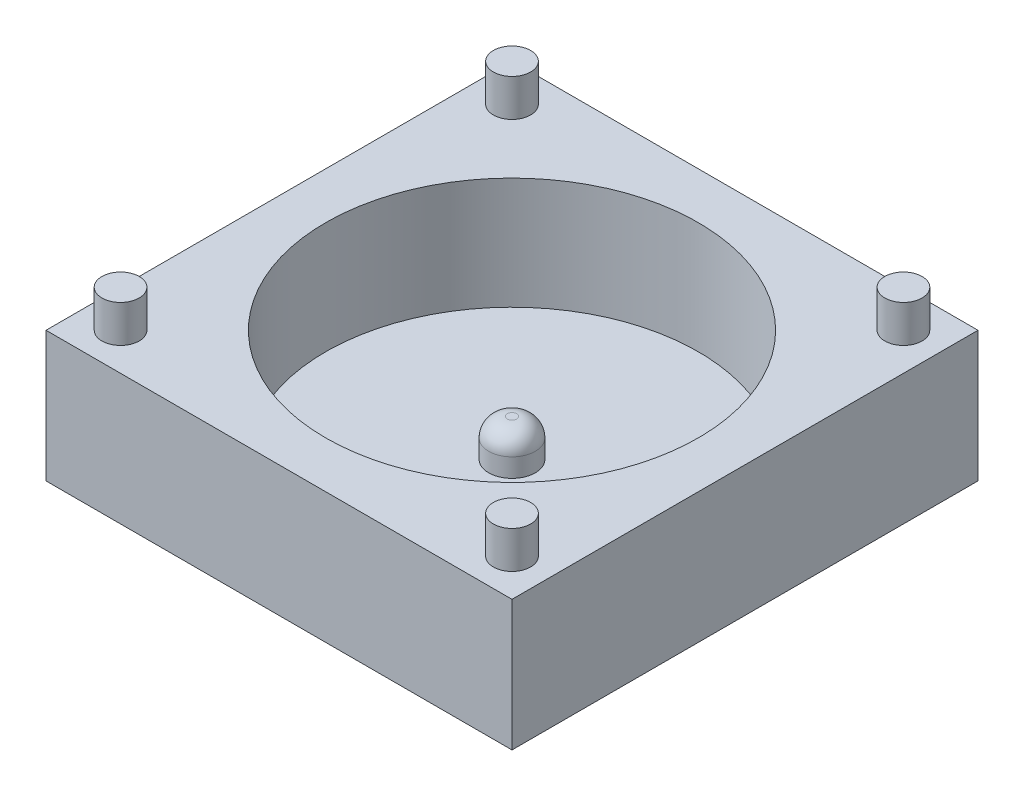
ISO-10303-21;
HEADER;
FILE_DESCRIPTION(('STEP AP214'),'2;1');
FILE_NAME('part.step','',(''),(''),'','','');
FILE_SCHEMA(('AUTOMOTIVE_DESIGN { 1 0 10303 214 1 1 1 1 }'));
ENDSEC;
DATA;
#1=APPLICATION_CONTEXT('core data for automotive mechanical design processes');
#2=APPLICATION_PROTOCOL_DEFINITION('international standard','automotive_design',2000,#1);
#3=PRODUCT_CONTEXT('',#1,'mechanical');
#4=PRODUCT('Part','Part','',(#3));
#5=PRODUCT_RELATED_PRODUCT_CATEGORY('part','',(#4));
#6=PRODUCT_DEFINITION_FORMATION('','',#4);
#7=PRODUCT_DEFINITION_CONTEXT('part definition',#1,'design');
#8=PRODUCT_DEFINITION('design','',#6,#7);
#9=PRODUCT_DEFINITION_SHAPE('','',#8);
#10=(LENGTH_UNIT() NAMED_UNIT(*) SI_UNIT(.MILLI.,.METRE.));
#11=(NAMED_UNIT(*) PLANE_ANGLE_UNIT() SI_UNIT($,.RADIAN.));
#12=(NAMED_UNIT(*) SI_UNIT($,.STERADIAN.) SOLID_ANGLE_UNIT());
#13=UNCERTAINTY_MEASURE_WITH_UNIT(LENGTH_MEASURE(1.E-05),#10,'distance_accuracy_value','');
#14=(GEOMETRIC_REPRESENTATION_CONTEXT(3) GLOBAL_UNCERTAINTY_ASSIGNED_CONTEXT((#13)) GLOBAL_UNIT_ASSIGNED_CONTEXT((#10,
#11,#12)) REPRESENTATION_CONTEXT('',''));
#15=CARTESIAN_POINT('',(0.,0.,0.));
#16=DIRECTION('',(0.,0.,1.));
#17=DIRECTION('',(1.,0.,0.));
#18=AXIS2_PLACEMENT_3D('',#15,#16,#17);
#19=CARTESIAN_POINT('',(12.5,7.,12.5));
#20=DIRECTION('',(-1.,0.,0.));
#21=DIRECTION('',(0.,0.,1.));
#22=AXIS2_PLACEMENT_3D('',#19,#20,#21);
#23=PLANE('',#22);
#24=DIRECTION('',(0.,0.,-1.));
#25=VECTOR('',#24,1.);
#26=CARTESIAN_POINT('',(12.5,0.,12.5));
#27=LINE('',#26,#25);
#28=CARTESIAN_POINT('',(12.5,0.,12.5));
#29=VERTEX_POINT('',#28);
#30=CARTESIAN_POINT('',(12.5,0.,-12.5));
#31=VERTEX_POINT('',#30);
#32=EDGE_CURVE('E103',#29,#31,#27,.T.);
#33=ORIENTED_EDGE('',*,*,#32,.T.);
#34=DIRECTION('',(0.,-1.,0.));
#35=VECTOR('',#34,1.);
#36=CARTESIAN_POINT('',(12.5,7.,-12.5));
#37=LINE('',#36,#35);
#38=CARTESIAN_POINT('',(12.5,7.,-12.5));
#39=VERTEX_POINT('',#38);
#40=EDGE_CURVE('E94',#39,#31,#37,.T.);
#41=ORIENTED_EDGE('',*,*,#40,.F.);
#42=DIRECTION('',(0.,0.,-1.));
#43=VECTOR('',#42,1.);
#44=CARTESIAN_POINT('',(12.5,7.,12.5));
#45=LINE('',#44,#43);
#46=CARTESIAN_POINT('',(12.5,7.,12.5));
#47=VERTEX_POINT('',#46);
#48=EDGE_CURVE('E88',#47,#39,#45,.T.);
#49=ORIENTED_EDGE('',*,*,#48,.F.);
#50=DIRECTION('',(0.,-1.,0.));
#51=VECTOR('',#50,1.);
#52=CARTESIAN_POINT('',(12.5,7.,12.5));
#53=LINE('',#52,#51);
#54=EDGE_CURVE('E99',#47,#29,#53,.T.);
#55=ORIENTED_EDGE('',*,*,#54,.T.);
#56=EDGE_LOOP('',(#33,#41,#49,#55));
#57=FACE_BOUND('',#56,.T.);
#58=ADVANCED_FACE('F35',(#57),#23,.F.);
#59=CARTESIAN_POINT('',(-12.5,7.,-12.5));
#60=DIRECTION('',(0.,0.,1.));
#61=DIRECTION('',(1.,0.,0.));
#62=AXIS2_PLACEMENT_3D('',#59,#60,#61);
#63=PLANE('',#62);
#64=DIRECTION('',(-1.,0.,0.));
#65=VECTOR('',#64,1.);
#66=CARTESIAN_POINT('',(-12.5,0.,-12.5));
#67=LINE('',#66,#65);
#68=CARTESIAN_POINT('',(-12.5,0.,-12.5));
#69=VERTEX_POINT('',#68);
#70=EDGE_CURVE('E93',#31,#69,#67,.T.);
#71=ORIENTED_EDGE('',*,*,#70,.T.);
#72=DIRECTION('',(0.,-1.,0.));
#73=VECTOR('',#72,1.);
#74=CARTESIAN_POINT('',(-12.5,7.,-12.5));
#75=LINE('',#74,#73);
#76=CARTESIAN_POINT('',(-12.5,7.,-12.5));
#77=VERTEX_POINT('',#76);
#78=EDGE_CURVE('E91',#77,#69,#75,.T.);
#79=ORIENTED_EDGE('',*,*,#78,.F.);
#80=DIRECTION('',(-1.,0.,0.));
#81=VECTOR('',#80,1.);
#82=CARTESIAN_POINT('',(-12.5,7.,-12.5));
#83=LINE('',#82,#81);
#84=EDGE_CURVE('E83',#39,#77,#83,.T.);
#85=ORIENTED_EDGE('',*,*,#84,.F.);
#86=ORIENTED_EDGE('',*,*,#40,.T.);
#87=EDGE_LOOP('',(#71,#79,#85,#86));
#88=FACE_BOUND('',#87,.T.);
#89=ADVANCED_FACE('F92',(#88),#63,.F.);
#90=CARTESIAN_POINT('',(-12.5,7.,12.5));
#91=DIRECTION('',(1.,0.,0.));
#92=DIRECTION('',(0.,0.,-1.));
#93=AXIS2_PLACEMENT_3D('',#90,#91,#92);
#94=PLANE('',#93);
#95=DIRECTION('',(0.,0.,1.));
#96=VECTOR('',#95,1.);
#97=CARTESIAN_POINT('',(-12.5,0.,12.5));
#98=LINE('',#97,#96);
#99=CARTESIAN_POINT('',(-12.5,0.,12.5));
#100=VERTEX_POINT('',#99);
#101=EDGE_CURVE('E69',#69,#100,#98,.T.);
#102=ORIENTED_EDGE('',*,*,#101,.T.);
#103=DIRECTION('',(0.,-1.,0.));
#104=VECTOR('',#103,1.);
#105=CARTESIAN_POINT('',(-12.5,7.,12.5));
#106=LINE('',#105,#104);
#107=CARTESIAN_POINT('',(-12.5,7.,12.5));
#108=VERTEX_POINT('',#107);
#109=EDGE_CURVE('E95',#108,#100,#106,.T.);
#110=ORIENTED_EDGE('',*,*,#109,.F.);
#111=DIRECTION('',(0.,0.,1.));
#112=VECTOR('',#111,1.);
#113=CARTESIAN_POINT('',(-12.5,7.,12.5));
#114=LINE('',#113,#112);
#115=EDGE_CURVE('E86',#77,#108,#114,.T.);
#116=ORIENTED_EDGE('',*,*,#115,.F.);
#117=ORIENTED_EDGE('',*,*,#78,.T.);
#118=EDGE_LOOP('',(#102,#110,#116,#117));
#119=FACE_BOUND('',#118,.T.);
#120=ADVANCED_FACE('F97',(#119),#94,.F.);
#121=CARTESIAN_POINT('',(-12.5,7.,12.5));
#122=DIRECTION('',(0.,0.,-1.));
#123=DIRECTION('',(-1.,0.,0.));
#124=AXIS2_PLACEMENT_3D('',#121,#122,#123);
#125=PLANE('',#124);
#126=DIRECTION('',(1.,0.,0.));
#127=VECTOR('',#126,1.);
#128=CARTESIAN_POINT('',(-12.5,0.,12.5));
#129=LINE('',#128,#127);
#130=EDGE_CURVE('E75',#100,#29,#129,.T.);
#131=ORIENTED_EDGE('',*,*,#130,.T.);
#132=ORIENTED_EDGE('',*,*,#54,.F.);
#133=DIRECTION('',(1.,0.,0.));
#134=VECTOR('',#133,1.);
#135=CARTESIAN_POINT('',(-12.5,7.,12.5));
#136=LINE('',#135,#134);
#137=EDGE_CURVE('E52',#108,#47,#136,.T.);
#138=ORIENTED_EDGE('',*,*,#137,.F.);
#139=ORIENTED_EDGE('',*,*,#109,.T.);
#140=EDGE_LOOP('',(#131,#132,#138,#139));
#141=FACE_BOUND('',#140,.T.);
#142=ADVANCED_FACE('F132',(#141),#125,.F.);
#143=CARTESIAN_POINT('',(0.,7.,0.));
#144=DIRECTION('',(0.,-1.,0.));
#145=DIRECTION('',(0.,0.,-1.));
#146=AXIS2_PLACEMENT_3D('',#143,#144,#145);
#147=PLANE('',#146);
#148=CARTESIAN_POINT('',(-10.5,7.,10.5));
#149=DIRECTION('',(0.,-1.,0.));
#150=DIRECTION('',(0.,0.,-1.));
#151=AXIS2_PLACEMENT_3D('',#148,#149,#150);
#152=CIRCLE('',#151,1.);
#153=CARTESIAN_POINT('',(-10.5,7.,9.5));
#154=VERTEX_POINT('',#153);
#155=EDGE_CURVE('E11',#154,#154,#152,.F.);
#156=ORIENTED_EDGE('',*,*,#155,.F.);
#157=EDGE_LOOP('',(#156));
#158=FACE_BOUND('',#157,.T.);
#159=CARTESIAN_POINT('',(10.5,7.,10.5));
#160=DIRECTION('',(0.,-1.,0.));
#161=DIRECTION('',(0.,0.,-1.));
#162=AXIS2_PLACEMENT_3D('',#159,#160,#161);
#163=CIRCLE('',#162,1.);
#164=CARTESIAN_POINT('',(10.5,7.,9.5));
#165=VERTEX_POINT('',#164);
#166=EDGE_CURVE('E44',#165,#165,#163,.F.);
#167=ORIENTED_EDGE('',*,*,#166,.F.);
#168=EDGE_LOOP('',(#167));
#169=FACE_BOUND('',#168,.T.);
#170=CARTESIAN_POINT('',(10.5,7.,-10.5));
#171=DIRECTION('',(0.,-1.,0.));
#172=DIRECTION('',(0.,0.,-1.));
#173=AXIS2_PLACEMENT_3D('',#170,#171,#172);
#174=CIRCLE('',#173,1.);
#175=CARTESIAN_POINT('',(10.5,7.,-11.5));
#176=VERTEX_POINT('',#175);
#177=EDGE_CURVE('E122',#176,#176,#174,.F.);
#178=ORIENTED_EDGE('',*,*,#177,.F.);
#179=EDGE_LOOP('',(#178));
#180=FACE_BOUND('',#179,.T.);
#181=CARTESIAN_POINT('',(-10.5,7.,-10.5));
#182=DIRECTION('',(0.,-1.,0.));
#183=DIRECTION('',(0.,0.,-1.));
#184=AXIS2_PLACEMENT_3D('',#181,#182,#183);
#185=CIRCLE('',#184,1.);
#186=CARTESIAN_POINT('',(-10.5,7.,-11.5));
#187=VERTEX_POINT('',#186);
#188=EDGE_CURVE('E119',#187,#187,#185,.F.);
#189=ORIENTED_EDGE('',*,*,#188,.F.);
#190=EDGE_LOOP('',(#189));
#191=FACE_BOUND('',#190,.T.);
#192=CARTESIAN_POINT('',(0.,7.,0.));
#193=DIRECTION('',(0.,1.,0.));
#194=DIRECTION('',(0.,0.,1.));
#195=AXIS2_PLACEMENT_3D('',#192,#193,#194);
#196=CIRCLE('',#195,10.);
#197=CARTESIAN_POINT('',(0.,7.,10.));
#198=VERTEX_POINT('',#197);
#199=EDGE_CURVE('E141',#198,#198,#196,.T.);
#200=ORIENTED_EDGE('',*,*,#199,.F.);
#201=EDGE_LOOP('',(#200));
#202=FACE_BOUND('',#201,.T.);
#203=ORIENTED_EDGE('',*,*,#48,.T.);
#204=ORIENTED_EDGE('',*,*,#84,.T.);
#205=ORIENTED_EDGE('',*,*,#115,.T.);
#206=ORIENTED_EDGE('',*,*,#137,.T.);
#207=EDGE_LOOP('',(#203,#204,#205,#206));
#208=FACE_BOUND('',#207,.T.);
#209=ADVANCED_FACE('F84',(#158,#169,#180,#191,#202,#208),#147,.F.);
#210=CARTESIAN_POINT('',(0.,0.,0.));
#211=DIRECTION('',(0.,-1.,0.));
#212=DIRECTION('',(0.,0.,-1.));
#213=AXIS2_PLACEMENT_3D('',#210,#211,#212);
#214=PLANE('',#213);
#215=ORIENTED_EDGE('',*,*,#32,.F.);
#216=ORIENTED_EDGE('',*,*,#130,.F.);
#217=ORIENTED_EDGE('',*,*,#101,.F.);
#218=ORIENTED_EDGE('',*,*,#70,.F.);
#219=EDGE_LOOP('',(#215,#216,#217,#218));
#220=FACE_BOUND('',#219,.T.);
#221=ADVANCED_FACE('F131',(#220),#214,.T.);
#222=CARTESIAN_POINT('',(0.,1.,0.));
#223=DIRECTION('',(0.,1.,0.));
#224=DIRECTION('',(0.,0.,1.));
#225=AXIS2_PLACEMENT_3D('',#222,#223,#224);
#226=CYLINDRICAL_SURFACE('',#225,10.);
#227=CARTESIAN_POINT('',(0.,1.,0.));
#228=DIRECTION('',(0.,1.,0.));
#229=DIRECTION('',(0.,0.,1.));
#230=AXIS2_PLACEMENT_3D('',#227,#228,#229);
#231=CIRCLE('',#230,10.);
#232=CARTESIAN_POINT('',(0.,1.,10.));
#233=VERTEX_POINT('',#232);
#234=EDGE_CURVE('E106',#233,#233,#231,.T.);
#235=ORIENTED_EDGE('',*,*,#234,.F.);
#236=EDGE_LOOP('',(#235));
#237=FACE_BOUND('',#236,.T.);
#238=ORIENTED_EDGE('',*,*,#199,.T.);
#239=EDGE_LOOP('',(#238));
#240=FACE_BOUND('',#239,.T.);
#241=ADVANCED_FACE('F190',(#237,#240),#226,.F.);
#242=CARTESIAN_POINT('',(0.,1.,0.));
#243=DIRECTION('',(0.,1.,0.));
#244=DIRECTION('',(0.,0.,1.));
#245=AXIS2_PLACEMENT_3D('',#242,#243,#244);
#246=PLANE('',#245);
#247=CARTESIAN_POINT('',(0.,1.,0.));
#248=DIRECTION('',(0.,1.,0.));
#249=DIRECTION('',(0.,0.,1.));
#250=AXIS2_PLACEMENT_3D('',#247,#248,#249);
#251=CIRCLE('',#250,1.25);
#252=CARTESIAN_POINT('',(0.,1.,1.25));
#253=VERTEX_POINT('',#252);
#254=EDGE_CURVE('E143',#253,#253,#251,.T.);
#255=ORIENTED_EDGE('',*,*,#254,.F.);
#256=EDGE_LOOP('',(#255));
#257=FACE_BOUND('',#256,.T.);
#258=ORIENTED_EDGE('',*,*,#234,.T.);
#259=EDGE_LOOP('',(#258));
#260=FACE_BOUND('',#259,.T.);
#261=ADVANCED_FACE('F195',(#257,#260),#246,.T.);
#262=CARTESIAN_POINT('',(0.,3.,0.));
#263=DIRECTION('',(0.,-1.,0.));
#264=DIRECTION('',(0.,0.,-1.));
#265=AXIS2_PLACEMENT_3D('',#262,#263,#264);
#266=CYLINDRICAL_SURFACE('',#265,1.25);
#267=CARTESIAN_POINT('',(0.,2.,0.));
#268=DIRECTION('',(0.,1.,0.));
#269=DIRECTION('',(0.,0.,1.));
#270=AXIS2_PLACEMENT_3D('',#267,#268,#269);
#271=CIRCLE('',#270,1.25);
#272=CARTESIAN_POINT('',(0.,2.,1.25));
#273=VERTEX_POINT('',#272);
#274=EDGE_CURVE('E116',#273,#273,#271,.F.);
#275=ORIENTED_EDGE('',*,*,#274,.T.);
#276=EDGE_LOOP('',(#275));
#277=FACE_BOUND('',#276,.T.);
#278=ORIENTED_EDGE('',*,*,#254,.T.);
#279=EDGE_LOOP('',(#278));
#280=FACE_BOUND('',#279,.T.);
#281=ADVANCED_FACE('F199',(#277,#280),#266,.T.);
#282=CARTESIAN_POINT('',(0.,3.,0.));
#283=DIRECTION('',(0.,1.,0.));
#284=DIRECTION('',(0.,0.,1.));
#285=AXIS2_PLACEMENT_3D('',#282,#283,#284);
#286=PLANE('',#285);
#287=CARTESIAN_POINT('',(0.,3.,0.));
#288=DIRECTION('',(0.,1.,0.));
#289=DIRECTION('',(0.,0.,1.));
#290=AXIS2_PLACEMENT_3D('',#287,#288,#289);
#291=CIRCLE('',#290,0.25);
#292=CARTESIAN_POINT('',(0.,3.,0.25));
#293=VERTEX_POINT('',#292);
#294=EDGE_CURVE('E113',#293,#293,#291,.T.);
#295=ORIENTED_EDGE('',*,*,#294,.T.);
#296=EDGE_LOOP('',(#295));
#297=FACE_BOUND('',#296,.T.);
#298=ADVANCED_FACE('F203',(#297),#286,.T.);
#299=CARTESIAN_POINT('',(0.,2.,0.));
#300=DIRECTION('',(0.,1.,0.));
#301=DIRECTION('',(0.,0.,1.));
#302=AXIS2_PLACEMENT_3D('',#299,#300,#301);
#303=DEGENERATE_TOROIDAL_SURFACE('',#302,0.25,1.,.T.);
#304=ORIENTED_EDGE('',*,*,#274,.F.);
#305=EDGE_LOOP('',(#304));
#306=FACE_BOUND('',#305,.T.);
#307=ORIENTED_EDGE('',*,*,#294,.F.);
#308=EDGE_LOOP('',(#307));
#309=FACE_BOUND('',#308,.T.);
#310=ADVANCED_FACE('F37',(#306,#309),#303,.T.);
#311=CARTESIAN_POINT('',(-10.5,9.,-10.5));
#312=DIRECTION('',(0.,-1.,0.));
#313=DIRECTION('',(0.,0.,-1.));
#314=AXIS2_PLACEMENT_3D('',#311,#312,#313);
#315=CYLINDRICAL_SURFACE('',#314,1.);
#316=CARTESIAN_POINT('',(-10.5,9.,-10.5));
#317=DIRECTION('',(0.,1.,0.));
#318=DIRECTION('',(0.,0.,1.));
#319=AXIS2_PLACEMENT_3D('',#316,#317,#318);
#320=CIRCLE('',#319,1.);
#321=CARTESIAN_POINT('',(-10.5,9.,-9.5));
#322=VERTEX_POINT('',#321);
#323=EDGE_CURVE('E148',#322,#322,#320,.T.);
#324=ORIENTED_EDGE('',*,*,#323,.F.);
#325=EDGE_LOOP('',(#324));
#326=FACE_BOUND('',#325,.T.);
#327=ORIENTED_EDGE('',*,*,#188,.T.);
#328=EDGE_LOOP('',(#327));
#329=FACE_BOUND('',#328,.T.);
#330=ADVANCED_FACE('F208',(#326,#329),#315,.T.);
#331=CARTESIAN_POINT('',(-10.5,9.,-10.5));
#332=DIRECTION('',(0.,1.,0.));
#333=DIRECTION('',(0.,0.,1.));
#334=AXIS2_PLACEMENT_3D('',#331,#332,#333);
#335=PLANE('',#334);
#336=ORIENTED_EDGE('',*,*,#323,.T.);
#337=EDGE_LOOP('',(#336));
#338=FACE_BOUND('',#337,.T.);
#339=ADVANCED_FACE('F211',(#338),#335,.T.);
#340=CARTESIAN_POINT('',(10.5,9.,-10.5));
#341=DIRECTION('',(0.,-1.,0.));
#342=DIRECTION('',(0.,0.,-1.));
#343=AXIS2_PLACEMENT_3D('',#340,#341,#342);
#344=CYLINDRICAL_SURFACE('',#343,1.);
#345=CARTESIAN_POINT('',(10.5,9.,-10.5));
#346=DIRECTION('',(0.,1.,0.));
#347=DIRECTION('',(0.,0.,1.));
#348=AXIS2_PLACEMENT_3D('',#345,#346,#347);
#349=CIRCLE('',#348,1.);
#350=CARTESIAN_POINT('',(10.5,9.,-9.5));
#351=VERTEX_POINT('',#350);
#352=EDGE_CURVE('E153',#351,#351,#349,.T.);
#353=ORIENTED_EDGE('',*,*,#352,.F.);
#354=EDGE_LOOP('',(#353));
#355=FACE_BOUND('',#354,.T.);
#356=ORIENTED_EDGE('',*,*,#177,.T.);
#357=EDGE_LOOP('',(#356));
#358=FACE_BOUND('',#357,.T.);
#359=ADVANCED_FACE('F215',(#355,#358),#344,.T.);
#360=CARTESIAN_POINT('',(10.5,9.,-10.5));
#361=DIRECTION('',(0.,1.,0.));
#362=DIRECTION('',(0.,0.,1.));
#363=AXIS2_PLACEMENT_3D('',#360,#361,#362);
#364=PLANE('',#363);
#365=ORIENTED_EDGE('',*,*,#352,.T.);
#366=EDGE_LOOP('',(#365));
#367=FACE_BOUND('',#366,.T.);
#368=ADVANCED_FACE('F219',(#367),#364,.T.);
#369=CARTESIAN_POINT('',(10.5,9.,10.5));
#370=DIRECTION('',(0.,-1.,0.));
#371=DIRECTION('',(0.,0.,-1.));
#372=AXIS2_PLACEMENT_3D('',#369,#370,#371);
#373=CYLINDRICAL_SURFACE('',#372,1.);
#374=CARTESIAN_POINT('',(10.5,9.,10.5));
#375=DIRECTION('',(0.,1.,0.));
#376=DIRECTION('',(0.,0.,1.));
#377=AXIS2_PLACEMENT_3D('',#374,#375,#376);
#378=CIRCLE('',#377,1.);
#379=CARTESIAN_POINT('',(10.5,9.,11.5));
#380=VERTEX_POINT('',#379);
#381=EDGE_CURVE('E156',#380,#380,#378,.T.);
#382=ORIENTED_EDGE('',*,*,#381,.F.);
#383=EDGE_LOOP('',(#382));
#384=FACE_BOUND('',#383,.T.);
#385=ORIENTED_EDGE('',*,*,#166,.T.);
#386=EDGE_LOOP('',(#385));
#387=FACE_BOUND('',#386,.T.);
#388=ADVANCED_FACE('F127',(#384,#387),#373,.T.);
#389=CARTESIAN_POINT('',(10.5,9.,10.5));
#390=DIRECTION('',(0.,1.,0.));
#391=DIRECTION('',(0.,0.,1.));
#392=AXIS2_PLACEMENT_3D('',#389,#390,#391);
#393=PLANE('',#392);
#394=ORIENTED_EDGE('',*,*,#381,.T.);
#395=EDGE_LOOP('',(#394));
#396=FACE_BOUND('',#395,.T.);
#397=ADVANCED_FACE('F168',(#396),#393,.T.);
#398=CARTESIAN_POINT('',(-10.5,9.,10.5));
#399=DIRECTION('',(0.,-1.,0.));
#400=DIRECTION('',(0.,0.,-1.));
#401=AXIS2_PLACEMENT_3D('',#398,#399,#400);
#402=CYLINDRICAL_SURFACE('',#401,1.);
#403=CARTESIAN_POINT('',(-10.5,9.,10.5));
#404=DIRECTION('',(0.,1.,0.));
#405=DIRECTION('',(0.,0.,1.));
#406=AXIS2_PLACEMENT_3D('',#403,#404,#405);
#407=CIRCLE('',#406,1.);
#408=CARTESIAN_POINT('',(-10.5,9.,11.5));
#409=VERTEX_POINT('',#408);
#410=EDGE_CURVE('E159',#409,#409,#407,.T.);
#411=ORIENTED_EDGE('',*,*,#410,.F.);
#412=EDGE_LOOP('',(#411));
#413=FACE_BOUND('',#412,.T.);
#414=ORIENTED_EDGE('',*,*,#155,.T.);
#415=EDGE_LOOP('',(#414));
#416=FACE_BOUND('',#415,.T.);
#417=ADVANCED_FACE('F165',(#413,#416),#402,.T.);
#418=CARTESIAN_POINT('',(-10.5,9.,10.5));
#419=DIRECTION('',(0.,1.,0.));
#420=DIRECTION('',(0.,0.,1.));
#421=AXIS2_PLACEMENT_3D('',#418,#419,#420);
#422=PLANE('',#421);
#423=ORIENTED_EDGE('',*,*,#410,.T.);
#424=EDGE_LOOP('',(#423));
#425=FACE_BOUND('',#424,.T.);
#426=ADVANCED_FACE('F163',(#425),#422,.T.);
#427=CLOSED_SHELL('',(#58,#89,#120,#142,#209,#221,#241,#261,#281,#298,#310,#330,#339,#359,#368,
#388,#397,#417,#426));
#428=MANIFOLD_SOLID_BREP('B2',#427);
#429=ADVANCED_BREP_SHAPE_REPRESENTATION('',(#18,#428),#14);
#430=SHAPE_DEFINITION_REPRESENTATION(#9,#429);
ENDSEC;
END-ISO-10303-21;
